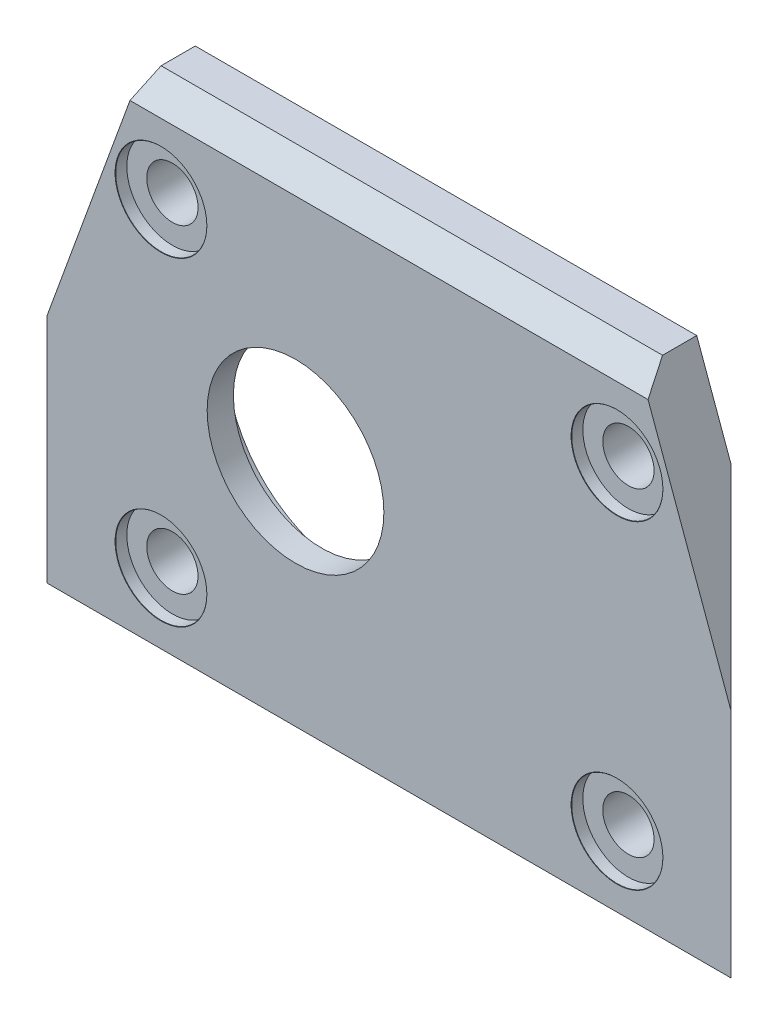
ISO-10303-21;
HEADER;
FILE_DESCRIPTION(('STEP AP214'),'2;1');
FILE_NAME('part.step','',(''),(''),'','','');
FILE_SCHEMA(('AUTOMOTIVE_DESIGN { 1 0 10303 214 1 1 1 1 }'));
ENDSEC;
DATA;
#1=APPLICATION_CONTEXT('core data for automotive mechanical design processes');
#2=APPLICATION_PROTOCOL_DEFINITION('international standard','automotive_design',2000,#1);
#3=PRODUCT_CONTEXT('',#1,'mechanical');
#4=PRODUCT('Part','Part','',(#3));
#5=PRODUCT_RELATED_PRODUCT_CATEGORY('part','',(#4));
#6=PRODUCT_DEFINITION_FORMATION('','',#4);
#7=PRODUCT_DEFINITION_CONTEXT('part definition',#1,'design');
#8=PRODUCT_DEFINITION('design','',#6,#7);
#9=PRODUCT_DEFINITION_SHAPE('','',#8);
#10=(LENGTH_UNIT() NAMED_UNIT(*) SI_UNIT(.MILLI.,.METRE.));
#11=(NAMED_UNIT(*) PLANE_ANGLE_UNIT() SI_UNIT($,.RADIAN.));
#12=(NAMED_UNIT(*) SI_UNIT($,.STERADIAN.) SOLID_ANGLE_UNIT());
#13=UNCERTAINTY_MEASURE_WITH_UNIT(LENGTH_MEASURE(1.E-05),#10,'distance_accuracy_value','');
#14=(GEOMETRIC_REPRESENTATION_CONTEXT(3) GLOBAL_UNCERTAINTY_ASSIGNED_CONTEXT((#13)) GLOBAL_UNIT_ASSIGNED_CONTEXT((#10,
#11,#12)) REPRESENTATION_CONTEXT('',''));
#15=CARTESIAN_POINT('',(0.,0.,0.));
#16=DIRECTION('',(0.,0.,1.));
#17=DIRECTION('',(1.,0.,0.));
#18=AXIS2_PLACEMENT_3D('',#15,#16,#17);
#19=CARTESIAN_POINT('',(-8.2,0.,5.));
#20=DIRECTION('',(0.,0.,-1.));
#21=DIRECTION('',(-1.,0.,0.));
#22=AXIS2_PLACEMENT_3D('',#19,#20,#21);
#23=CYLINDRICAL_SURFACE('',#22,7.75);
#24=CARTESIAN_POINT('',(-8.2,0.,5.));
#25=DIRECTION('',(0.,0.,1.));
#26=DIRECTION('',(1.,0.,0.));
#27=AXIS2_PLACEMENT_3D('',#24,#25,#26);
#28=CIRCLE('',#27,7.75);
#29=CARTESIAN_POINT('',(-0.450000000000001,0.,5.));
#30=VERTEX_POINT('',#29);
#31=EDGE_CURVE('E195',#30,#30,#28,.T.);
#32=ORIENTED_EDGE('',*,*,#31,.T.);
#33=EDGE_LOOP('',(#32));
#34=FACE_BOUND('',#33,.T.);
#35=CARTESIAN_POINT('',(-8.2,0.,2.7));
#36=DIRECTION('',(0.,0.,-1.));
#37=DIRECTION('',(-1.,0.,0.));
#38=AXIS2_PLACEMENT_3D('',#35,#36,#37);
#39=CIRCLE('',#38,7.75);
#40=CARTESIAN_POINT('',(-15.95,0.,2.7));
#41=VERTEX_POINT('',#40);
#42=EDGE_CURVE('E135',#41,#41,#39,.T.);
#43=ORIENTED_EDGE('',*,*,#42,.T.);
#44=EDGE_LOOP('',(#43));
#45=FACE_BOUND('',#44,.T.);
#46=ADVANCED_FACE('F35',(#34,#45),#23,.F.);
#47=CARTESIAN_POINT('',(-20.,14.,5.));
#48=DIRECTION('',(0.,0.,-1.));
#49=DIRECTION('',(-1.,0.,0.));
#50=AXIS2_PLACEMENT_3D('',#47,#48,#49);
#51=CYLINDRICAL_SURFACE('',#50,2.25);
#52=CARTESIAN_POINT('',(-20.,14.,0.));
#53=DIRECTION('',(0.,0.,1.));
#54=DIRECTION('',(1.,0.,0.));
#55=AXIS2_PLACEMENT_3D('',#52,#53,#54);
#56=CIRCLE('',#55,2.25);
#57=CARTESIAN_POINT('',(-17.75,14.,0.));
#58=VERTEX_POINT('',#57);
#59=EDGE_CURVE('E123',#58,#58,#56,.T.);
#60=ORIENTED_EDGE('',*,*,#59,.F.);
#61=EDGE_LOOP('',(#60));
#62=FACE_BOUND('',#61,.T.);
#63=CARTESIAN_POINT('',(-20.,14.,4.));
#64=DIRECTION('',(0.,0.,1.));
#65=DIRECTION('',(1.,0.,0.));
#66=AXIS2_PLACEMENT_3D('',#63,#64,#65);
#67=CIRCLE('',#66,2.25);
#68=CARTESIAN_POINT('',(-17.75,14.,4.));
#69=VERTEX_POINT('',#68);
#70=EDGE_CURVE('E234',#69,#69,#67,.T.);
#71=ORIENTED_EDGE('',*,*,#70,.T.);
#72=EDGE_LOOP('',(#71));
#73=FACE_BOUND('',#72,.T.);
#74=ADVANCED_FACE('F285',(#62,#73),#51,.F.);
#75=CARTESIAN_POINT('',(20.,14.,5.));
#76=DIRECTION('',(0.,0.,-1.));
#77=DIRECTION('',(-1.,0.,0.));
#78=AXIS2_PLACEMENT_3D('',#75,#76,#77);
#79=CYLINDRICAL_SURFACE('',#78,2.25);
#80=CARTESIAN_POINT('',(20.,14.,0.));
#81=DIRECTION('',(0.,0.,1.));
#82=DIRECTION('',(1.,0.,0.));
#83=AXIS2_PLACEMENT_3D('',#80,#81,#82);
#84=CIRCLE('',#83,2.25);
#85=CARTESIAN_POINT('',(22.25,14.,0.));
#86=VERTEX_POINT('',#85);
#87=EDGE_CURVE('E189',#86,#86,#84,.T.);
#88=ORIENTED_EDGE('',*,*,#87,.F.);
#89=EDGE_LOOP('',(#88));
#90=FACE_BOUND('',#89,.T.);
#91=CARTESIAN_POINT('',(20.,14.,4.));
#92=DIRECTION('',(0.,0.,1.));
#93=DIRECTION('',(1.,0.,0.));
#94=AXIS2_PLACEMENT_3D('',#91,#92,#93);
#95=CIRCLE('',#94,2.25);
#96=CARTESIAN_POINT('',(22.25,14.,4.));
#97=VERTEX_POINT('',#96);
#98=EDGE_CURVE('E222',#97,#97,#95,.T.);
#99=ORIENTED_EDGE('',*,*,#98,.T.);
#100=EDGE_LOOP('',(#99));
#101=FACE_BOUND('',#100,.T.);
#102=ADVANCED_FACE('F291',(#90,#101),#79,.F.);
#103=CARTESIAN_POINT('',(20.,-14.,5.));
#104=DIRECTION('',(0.,0.,-1.));
#105=DIRECTION('',(-1.,0.,0.));
#106=AXIS2_PLACEMENT_3D('',#103,#104,#105);
#107=CYLINDRICAL_SURFACE('',#106,2.25);
#108=CARTESIAN_POINT('',(20.,-14.,0.));
#109=DIRECTION('',(0.,0.,1.));
#110=DIRECTION('',(1.,0.,0.));
#111=AXIS2_PLACEMENT_3D('',#108,#109,#110);
#112=CIRCLE('',#111,2.25);
#113=CARTESIAN_POINT('',(22.25,-14.,0.));
#114=VERTEX_POINT('',#113);
#115=EDGE_CURVE('E192',#114,#114,#112,.T.);
#116=ORIENTED_EDGE('',*,*,#115,.F.);
#117=EDGE_LOOP('',(#116));
#118=FACE_BOUND('',#117,.T.);
#119=CARTESIAN_POINT('',(20.,-14.,4.));
#120=DIRECTION('',(0.,0.,1.));
#121=DIRECTION('',(1.,0.,0.));
#122=AXIS2_PLACEMENT_3D('',#119,#120,#121);
#123=CIRCLE('',#122,2.25);
#124=CARTESIAN_POINT('',(22.25,-14.,4.));
#125=VERTEX_POINT('',#124);
#126=EDGE_CURVE('E210',#125,#125,#123,.T.);
#127=ORIENTED_EDGE('',*,*,#126,.T.);
#128=EDGE_LOOP('',(#127));
#129=FACE_BOUND('',#128,.T.);
#130=ADVANCED_FACE('F296',(#118,#129),#107,.F.);
#131=CARTESIAN_POINT('',(0.,0.,5.));
#132=DIRECTION('',(0.,0.,-1.));
#133=DIRECTION('',(-1.,0.,0.));
#134=AXIS2_PLACEMENT_3D('',#131,#132,#133);
#135=PLANE('',#134);
#136=CARTESIAN_POINT('',(-20.,14.,5.));
#137=DIRECTION('',(0.,0.,1.));
#138=DIRECTION('',(1.,0.,0.));
#139=AXIS2_PLACEMENT_3D('',#136,#137,#138);
#140=CIRCLE('',#139,4.025);
#141=CARTESIAN_POINT('',(-15.975,14.,5.));
#142=VERTEX_POINT('',#141);
#143=EDGE_CURVE('E138',#142,#142,#140,.T.);
#144=ORIENTED_EDGE('',*,*,#143,.F.);
#145=EDGE_LOOP('',(#144));
#146=FACE_BOUND('',#145,.T.);
#147=CARTESIAN_POINT('',(20.,14.,5.));
#148=DIRECTION('',(0.,0.,1.));
#149=DIRECTION('',(1.,0.,0.));
#150=AXIS2_PLACEMENT_3D('',#147,#148,#149);
#151=CIRCLE('',#150,4.025);
#152=CARTESIAN_POINT('',(24.025,14.,5.));
#153=VERTEX_POINT('',#152);
#154=EDGE_CURVE('E231',#153,#153,#151,.T.);
#155=ORIENTED_EDGE('',*,*,#154,.F.);
#156=EDGE_LOOP('',(#155));
#157=FACE_BOUND('',#156,.T.);
#158=ORIENTED_EDGE('',*,*,#31,.F.);
#159=EDGE_LOOP('',(#158));
#160=FACE_BOUND('',#159,.T.);
#161=DIRECTION('',(0.,-1.,0.));
#162=VECTOR('',#161,1.);
#163=CARTESIAN_POINT('',(-30.,-22.15,5.));
#164=LINE('',#163,#162);
#165=CARTESIAN_POINT('',(-30.,0.149999999999786,5.));
#166=VERTEX_POINT('',#165);
#167=CARTESIAN_POINT('',(-30.,-20.15,5.));
#168=VERTEX_POINT('',#167);
#169=EDGE_CURVE('E132',#166,#168,#164,.T.);
#170=ORIENTED_EDGE('',*,*,#169,.T.);
#171=DIRECTION('',(1.,0.,0.));
#172=VECTOR('',#171,1.);
#173=CARTESIAN_POINT('',(0.,-20.15,5.));
#174=LINE('',#173,#172);
#175=CARTESIAN_POINT('',(30.,-20.15,5.));
#176=VERTEX_POINT('',#175);
#177=EDGE_CURVE('E150',#168,#176,#174,.T.);
#178=ORIENTED_EDGE('',*,*,#177,.T.);
#179=DIRECTION('',(0.,1.,0.));
#180=VECTOR('',#179,1.);
#181=CARTESIAN_POINT('',(30.,-22.15,5.));
#182=LINE('',#181,#180);
#183=CARTESIAN_POINT('',(30.,0.149999999999786,5.));
#184=VERTEX_POINT('',#183);
#185=EDGE_CURVE('E126',#176,#184,#182,.T.);
#186=ORIENTED_EDGE('',*,*,#185,.T.);
#187=DIRECTION('',(0.342020143325666,-0.939692620785909,0.));
#188=VECTOR('',#187,1.);
#189=CARTESIAN_POINT('',(21.9926548461435,22.15,5.));
#190=LINE('',#189,#188);
#191=CARTESIAN_POINT('',(22.7205953146759,20.15,5.));
#192=VERTEX_POINT('',#191);
#193=EDGE_CURVE('E144',#184,#192,#190,.F.);
#194=ORIENTED_EDGE('',*,*,#193,.T.);
#195=DIRECTION('',(-1.,0.,0.));
#196=VECTOR('',#195,1.);
#197=CARTESIAN_POINT('',(0.,20.15,5.));
#198=LINE('',#197,#196);
#199=CARTESIAN_POINT('',(-22.7205953146759,20.15,5.));
#200=VERTEX_POINT('',#199);
#201=EDGE_CURVE('E147',#192,#200,#198,.T.);
#202=ORIENTED_EDGE('',*,*,#201,.T.);
#203=DIRECTION('',(0.342020143325667,0.939692620785909,0.));
#204=VECTOR('',#203,1.);
#205=CARTESIAN_POINT('',(-30.,0.149999999999786,5.));
#206=LINE('',#205,#204);
#207=EDGE_CURVE('E116',#200,#166,#206,.F.);
#208=ORIENTED_EDGE('',*,*,#207,.T.);
#209=EDGE_LOOP('',(#170,#178,#186,#194,#202,#208));
#210=FACE_BOUND('',#209,.T.);
#211=CARTESIAN_POINT('',(-20.,-14.,5.));
#212=DIRECTION('',(0.,0.,1.));
#213=DIRECTION('',(1.,0.,0.));
#214=AXIS2_PLACEMENT_3D('',#211,#212,#213);
#215=CIRCLE('',#214,4.025);
#216=CARTESIAN_POINT('',(-15.975,-14.,5.));
#217=VERTEX_POINT('',#216);
#218=EDGE_CURVE('E207',#217,#217,#215,.T.);
#219=ORIENTED_EDGE('',*,*,#218,.F.);
#220=EDGE_LOOP('',(#219));
#221=FACE_BOUND('',#220,.T.);
#222=CARTESIAN_POINT('',(20.,-14.,5.));
#223=DIRECTION('',(0.,0.,1.));
#224=DIRECTION('',(1.,0.,0.));
#225=AXIS2_PLACEMENT_3D('',#222,#223,#224);
#226=CIRCLE('',#225,4.025);
#227=CARTESIAN_POINT('',(24.025,-14.,5.));
#228=VERTEX_POINT('',#227);
#229=EDGE_CURVE('E219',#228,#228,#226,.T.);
#230=ORIENTED_EDGE('',*,*,#229,.F.);
#231=EDGE_LOOP('',(#230));
#232=FACE_BOUND('',#231,.T.);
#233=ADVANCED_FACE('F178',(#146,#157,#160,#210,#221,#232),#135,.F.);
#234=CARTESIAN_POINT('',(0.,0.,0.));
#235=DIRECTION('',(0.,0.,-1.));
#236=DIRECTION('',(-1.,0.,0.));
#237=AXIS2_PLACEMENT_3D('',#234,#235,#236);
#238=PLANE('',#237);
#239=CARTESIAN_POINT('',(-8.2,0.,0.));
#240=DIRECTION('',(0.,0.,-1.));
#241=DIRECTION('',(-1.,0.,0.));
#242=AXIS2_PLACEMENT_3D('',#239,#240,#241);
#243=CIRCLE('',#242,11.1);
#244=CARTESIAN_POINT('',(-19.3,0.,0.));
#245=VERTEX_POINT('',#244);
#246=EDGE_CURVE('E245',#245,#245,#243,.T.);
#247=ORIENTED_EDGE('',*,*,#246,.F.);
#248=EDGE_LOOP('',(#247));
#249=FACE_BOUND('',#248,.T.);
#250=ORIENTED_EDGE('',*,*,#115,.T.);
#251=EDGE_LOOP('',(#250));
#252=FACE_BOUND('',#251,.T.);
#253=CARTESIAN_POINT('',(-20.,-14.,0.));
#254=DIRECTION('',(0.,0.,1.));
#255=DIRECTION('',(1.,0.,0.));
#256=AXIS2_PLACEMENT_3D('',#253,#254,#255);
#257=CIRCLE('',#256,2.25);
#258=CARTESIAN_POINT('',(-17.75,-14.,0.));
#259=VERTEX_POINT('',#258);
#260=EDGE_CURVE('E129',#259,#259,#257,.T.);
#261=ORIENTED_EDGE('',*,*,#260,.T.);
#262=EDGE_LOOP('',(#261));
#263=FACE_BOUND('',#262,.T.);
#264=DIRECTION('',(1.,0.,0.));
#265=VECTOR('',#264,1.);
#266=CARTESIAN_POINT('',(-30.,-22.15,0.));
#267=LINE('',#266,#265);
#268=CARTESIAN_POINT('',(-25.,-22.15,0.));
#269=VERTEX_POINT('',#268);
#270=CARTESIAN_POINT('',(25.,-22.15,0.));
#271=VERTEX_POINT('',#270);
#272=EDGE_CURVE('E122',#269,#271,#267,.T.);
#273=ORIENTED_EDGE('',*,*,#272,.F.);
#274=DIRECTION('',(0.,1.,0.));
#275=VECTOR('',#274,1.);
#276=CARTESIAN_POINT('',(-25.,0.149999999999786,0.));
#277=LINE('',#276,#275);
#278=CARTESIAN_POINT('',(-25.,13.887387097273,0.));
#279=VERTEX_POINT('',#278);
#280=EDGE_CURVE('E172',#269,#279,#277,.T.);
#281=ORIENTED_EDGE('',*,*,#280,.T.);
#282=DIRECTION('',(-0.342020143325667,-0.939692620785909,0.));
#283=VECTOR('',#282,1.);
#284=CARTESIAN_POINT('',(-26.5388757175111,9.65936081206409,0.));
#285=LINE('',#284,#283);
#286=CARTESIAN_POINT('',(-21.9926548461435,22.15,0.));
#287=VERTEX_POINT('',#286);
#288=EDGE_CURVE('E108',#279,#287,#285,.F.);
#289=ORIENTED_EDGE('',*,*,#288,.T.);
#290=DIRECTION('',(-1.,0.,0.));
#291=VECTOR('',#290,1.);
#292=CARTESIAN_POINT('',(-30.,22.15,0.));
#293=LINE('',#292,#291);
#294=CARTESIAN_POINT('',(21.9926548461435,22.15,0.));
#295=VERTEX_POINT('',#294);
#296=EDGE_CURVE('E104',#295,#287,#293,.T.);
#297=ORIENTED_EDGE('',*,*,#296,.F.);
#298=DIRECTION('',(-0.342020143325666,0.939692620785909,0.));
#299=VECTOR('',#298,1.);
#300=CARTESIAN_POINT('',(26.5388757175111,9.65936081206408,0.));
#301=LINE('',#300,#299);
#302=CARTESIAN_POINT('',(25.,13.887387097273,0.));
#303=VERTEX_POINT('',#302);
#304=EDGE_CURVE('E112',#295,#303,#301,.F.);
#305=ORIENTED_EDGE('',*,*,#304,.T.);
#306=DIRECTION('',(0.,-1.,0.));
#307=VECTOR('',#306,1.);
#308=CARTESIAN_POINT('',(25.,-22.15,0.));
#309=LINE('',#308,#307);
#310=EDGE_CURVE('E170',#303,#271,#309,.T.);
#311=ORIENTED_EDGE('',*,*,#310,.T.);
#312=EDGE_LOOP('',(#273,#281,#289,#297,#305,#311));
#313=FACE_BOUND('',#312,.T.);
#314=ORIENTED_EDGE('',*,*,#59,.T.);
#315=EDGE_LOOP('',(#314));
#316=FACE_BOUND('',#315,.T.);
#317=ORIENTED_EDGE('',*,*,#87,.T.);
#318=EDGE_LOOP('',(#317));
#319=FACE_BOUND('',#318,.T.);
#320=ADVANCED_FACE('F119',(#249,#252,#263,#313,#316,#319),#238,.T.);
#321=CARTESIAN_POINT('',(-30.,22.15,5.));
#322=DIRECTION('',(0.,-1.,0.));
#323=DIRECTION('',(0.,0.,-1.));
#324=AXIS2_PLACEMENT_3D('',#321,#322,#323);
#325=PLANE('',#324);
#326=DIRECTION('',(0.,0.,1.));
#327=VECTOR('',#326,1.);
#328=CARTESIAN_POINT('',(-21.9926548461435,22.15,5.));
#329=LINE('',#328,#327);
#330=CARTESIAN_POINT('',(-21.9926548461435,22.15,2.99999999999999));
#331=VERTEX_POINT('',#330);
#332=EDGE_CURVE('E109',#287,#331,#329,.T.);
#333=ORIENTED_EDGE('',*,*,#332,.T.);
#334=DIRECTION('',(1.,0.,0.));
#335=VECTOR('',#334,1.);
#336=CARTESIAN_POINT('',(-30.,22.15,2.99999999999999));
#337=LINE('',#336,#335);
#338=CARTESIAN_POINT('',(21.9926548461435,22.15,2.99999999999999));
#339=VERTEX_POINT('',#338);
#340=EDGE_CURVE('E107',#331,#339,#337,.T.);
#341=ORIENTED_EDGE('',*,*,#340,.T.);
#342=DIRECTION('',(0.,0.,-1.));
#343=VECTOR('',#342,1.);
#344=CARTESIAN_POINT('',(21.9926548461435,22.15,5.));
#345=LINE('',#344,#343);
#346=EDGE_CURVE('E100',#339,#295,#345,.T.);
#347=ORIENTED_EDGE('',*,*,#346,.T.);
#348=ORIENTED_EDGE('',*,*,#296,.T.);
#349=EDGE_LOOP('',(#333,#341,#347,#348));
#350=FACE_BOUND('',#349,.T.);
#351=ADVANCED_FACE('F102',(#350),#325,.F.);
#352=CARTESIAN_POINT('',(-30.,-22.15,5.));
#353=DIRECTION('',(0.,1.,0.));
#354=DIRECTION('',(0.,0.,1.));
#355=AXIS2_PLACEMENT_3D('',#352,#353,#354);
#356=PLANE('',#355);
#357=DIRECTION('',(-1.,0.,0.));
#358=VECTOR('',#357,1.);
#359=CARTESIAN_POINT('',(-30.,-22.15,2.99999999999999));
#360=LINE('',#359,#358);
#361=CARTESIAN_POINT('',(28.,-22.15,2.99999999999999));
#362=VERTEX_POINT('',#361);
#363=CARTESIAN_POINT('',(-28.,-22.15,2.99999999999999));
#364=VERTEX_POINT('',#363);
#365=EDGE_CURVE('E153',#362,#364,#360,.T.);
#366=ORIENTED_EDGE('',*,*,#365,.T.);
#367=DIRECTION('',(0.707106781186548,0.,-0.707106781186547));
#368=VECTOR('',#367,1.);
#369=CARTESIAN_POINT('',(-30.,-22.15,5.));
#370=LINE('',#369,#368);
#371=EDGE_CURVE('E168',#364,#269,#370,.T.);
#372=ORIENTED_EDGE('',*,*,#371,.T.);
#373=ORIENTED_EDGE('',*,*,#272,.T.);
#374=DIRECTION('',(0.707106781186548,0.,0.707106781186547));
#375=VECTOR('',#374,1.);
#376=CARTESIAN_POINT('',(30.,-22.15,5.));
#377=LINE('',#376,#375);
#378=EDGE_CURVE('E165',#271,#362,#377,.T.);
#379=ORIENTED_EDGE('',*,*,#378,.T.);
#380=EDGE_LOOP('',(#366,#372,#373,#379));
#381=FACE_BOUND('',#380,.T.);
#382=ADVANCED_FACE('F270',(#381),#356,.F.);
#383=CARTESIAN_POINT('',(-20.,-14.,5.));
#384=DIRECTION('',(0.,0.,-1.));
#385=DIRECTION('',(-1.,0.,0.));
#386=AXIS2_PLACEMENT_3D('',#383,#384,#385);
#387=CYLINDRICAL_SURFACE('',#386,2.25);
#388=CARTESIAN_POINT('',(-20.,-14.,4.));
#389=DIRECTION('',(0.,0.,1.));
#390=DIRECTION('',(1.,0.,0.));
#391=AXIS2_PLACEMENT_3D('',#388,#389,#390);
#392=CIRCLE('',#391,2.25);
#393=CARTESIAN_POINT('',(-17.75,-14.,4.));
#394=VERTEX_POINT('',#393);
#395=EDGE_CURVE('E198',#394,#394,#392,.T.);
#396=ORIENTED_EDGE('',*,*,#395,.T.);
#397=EDGE_LOOP('',(#396));
#398=FACE_BOUND('',#397,.T.);
#399=ORIENTED_EDGE('',*,*,#260,.F.);
#400=EDGE_LOOP('',(#399));
#401=FACE_BOUND('',#400,.T.);
#402=ADVANCED_FACE('F267',(#398,#401),#387,.F.);
#403=CARTESIAN_POINT('',(-16.,-14.,4.));
#404=DIRECTION('',(0.,0.,-1.));
#405=DIRECTION('',(-1.,0.,0.));
#406=AXIS2_PLACEMENT_3D('',#403,#404,#405);
#407=PLANE('',#406);
#408=ORIENTED_EDGE('',*,*,#395,.F.);
#409=EDGE_LOOP('',(#408));
#410=FACE_BOUND('',#409,.T.);
#411=CARTESIAN_POINT('',(-20.,-14.,4.));
#412=DIRECTION('',(0.,0.,1.));
#413=DIRECTION('',(1.,0.,0.));
#414=AXIS2_PLACEMENT_3D('',#411,#412,#413);
#415=CIRCLE('',#414,4.);
#416=CARTESIAN_POINT('',(-16.,-14.,4.));
#417=VERTEX_POINT('',#416);
#418=EDGE_CURVE('E201',#417,#417,#415,.T.);
#419=ORIENTED_EDGE('',*,*,#418,.T.);
#420=EDGE_LOOP('',(#419));
#421=FACE_BOUND('',#420,.T.);
#422=ADVANCED_FACE('F269',(#410,#421),#407,.F.);
#423=CARTESIAN_POINT('',(-20.,-14.,5.));
#424=DIRECTION('',(0.,0.,1.));
#425=DIRECTION('',(1.,0.,0.));
#426=AXIS2_PLACEMENT_3D('',#423,#424,#425);
#427=CYLINDRICAL_SURFACE('',#426,4.);
#428=ORIENTED_EDGE('',*,*,#418,.F.);
#429=EDGE_LOOP('',(#428));
#430=FACE_BOUND('',#429,.T.);
#431=CARTESIAN_POINT('',(-20.,-14.,4.975));
#432=DIRECTION('',(0.,0.,1.));
#433=DIRECTION('',(1.,0.,0.));
#434=AXIS2_PLACEMENT_3D('',#431,#432,#433);
#435=CIRCLE('',#434,4.);
#436=CARTESIAN_POINT('',(-16.,-14.,4.975));
#437=VERTEX_POINT('',#436);
#438=EDGE_CURVE('E204',#437,#437,#435,.T.);
#439=ORIENTED_EDGE('',*,*,#438,.T.);
#440=EDGE_LOOP('',(#439));
#441=FACE_BOUND('',#440,.T.);
#442=ADVANCED_FACE('F277',(#430,#441),#427,.F.);
#443=CARTESIAN_POINT('',(-20.,-14.,5.));
#444=DIRECTION('',(0.,0.,1.));
#445=DIRECTION('',(1.,0.,0.));
#446=AXIS2_PLACEMENT_3D('',#443,#444,#445);
#447=CONICAL_SURFACE('',#446,4.025,0.785398163397431);
#448=ORIENTED_EDGE('',*,*,#438,.F.);
#449=EDGE_LOOP('',(#448));
#450=FACE_BOUND('',#449,.T.);
#451=ORIENTED_EDGE('',*,*,#218,.T.);
#452=EDGE_LOOP('',(#451));
#453=FACE_BOUND('',#452,.T.);
#454=ADVANCED_FACE('F475',(#450,#453),#447,.F.);
#455=CARTESIAN_POINT('',(24.,-14.,4.));
#456=DIRECTION('',(0.,0.,-1.));
#457=DIRECTION('',(-1.,0.,0.));
#458=AXIS2_PLACEMENT_3D('',#455,#456,#457);
#459=PLANE('',#458);
#460=ORIENTED_EDGE('',*,*,#126,.F.);
#461=EDGE_LOOP('',(#460));
#462=FACE_BOUND('',#461,.T.);
#463=CARTESIAN_POINT('',(20.,-14.,4.));
#464=DIRECTION('',(0.,0.,1.));
#465=DIRECTION('',(1.,0.,0.));
#466=AXIS2_PLACEMENT_3D('',#463,#464,#465);
#467=CIRCLE('',#466,4.);
#468=CARTESIAN_POINT('',(24.,-14.,4.));
#469=VERTEX_POINT('',#468);
#470=EDGE_CURVE('E213',#469,#469,#467,.T.);
#471=ORIENTED_EDGE('',*,*,#470,.T.);
#472=EDGE_LOOP('',(#471));
#473=FACE_BOUND('',#472,.T.);
#474=ADVANCED_FACE('F465',(#462,#473),#459,.F.);
#475=CARTESIAN_POINT('',(20.,-14.,5.));
#476=DIRECTION('',(0.,0.,1.));
#477=DIRECTION('',(1.,0.,0.));
#478=AXIS2_PLACEMENT_3D('',#475,#476,#477);
#479=CYLINDRICAL_SURFACE('',#478,4.);
#480=ORIENTED_EDGE('',*,*,#470,.F.);
#481=EDGE_LOOP('',(#480));
#482=FACE_BOUND('',#481,.T.);
#483=CARTESIAN_POINT('',(20.,-14.,4.975));
#484=DIRECTION('',(0.,0.,1.));
#485=DIRECTION('',(1.,0.,0.));
#486=AXIS2_PLACEMENT_3D('',#483,#484,#485);
#487=CIRCLE('',#486,4.);
#488=CARTESIAN_POINT('',(24.,-14.,4.975));
#489=VERTEX_POINT('',#488);
#490=EDGE_CURVE('E216',#489,#489,#487,.T.);
#491=ORIENTED_EDGE('',*,*,#490,.T.);
#492=EDGE_LOOP('',(#491));
#493=FACE_BOUND('',#492,.T.);
#494=ADVANCED_FACE('F455',(#482,#493),#479,.F.);
#495=CARTESIAN_POINT('',(20.,-14.,5.));
#496=DIRECTION('',(0.,0.,1.));
#497=DIRECTION('',(1.,0.,0.));
#498=AXIS2_PLACEMENT_3D('',#495,#496,#497);
#499=CONICAL_SURFACE('',#498,4.025,0.785398163397431);
#500=ORIENTED_EDGE('',*,*,#490,.F.);
#501=EDGE_LOOP('',(#500));
#502=FACE_BOUND('',#501,.T.);
#503=ORIENTED_EDGE('',*,*,#229,.T.);
#504=EDGE_LOOP('',(#503));
#505=FACE_BOUND('',#504,.T.);
#506=ADVANCED_FACE('F311',(#502,#505),#499,.F.);
#507=CARTESIAN_POINT('',(24.,14.,4.));
#508=DIRECTION('',(0.,0.,-1.));
#509=DIRECTION('',(-1.,0.,0.));
#510=AXIS2_PLACEMENT_3D('',#507,#508,#509);
#511=PLANE('',#510);
#512=ORIENTED_EDGE('',*,*,#98,.F.);
#513=EDGE_LOOP('',(#512));
#514=FACE_BOUND('',#513,.T.);
#515=CARTESIAN_POINT('',(20.,14.,4.));
#516=DIRECTION('',(0.,0.,1.));
#517=DIRECTION('',(1.,0.,0.));
#518=AXIS2_PLACEMENT_3D('',#515,#516,#517);
#519=CIRCLE('',#518,4.);
#520=CARTESIAN_POINT('',(24.,14.,4.));
#521=VERTEX_POINT('',#520);
#522=EDGE_CURVE('E225',#521,#521,#519,.T.);
#523=ORIENTED_EDGE('',*,*,#522,.T.);
#524=EDGE_LOOP('',(#523));
#525=FACE_BOUND('',#524,.T.);
#526=ADVANCED_FACE('F307',(#514,#525),#511,.F.);
#527=CARTESIAN_POINT('',(20.,14.,5.));
#528=DIRECTION('',(0.,0.,1.));
#529=DIRECTION('',(1.,0.,0.));
#530=AXIS2_PLACEMENT_3D('',#527,#528,#529);
#531=CYLINDRICAL_SURFACE('',#530,4.);
#532=ORIENTED_EDGE('',*,*,#522,.F.);
#533=EDGE_LOOP('',(#532));
#534=FACE_BOUND('',#533,.T.);
#535=CARTESIAN_POINT('',(20.,14.,4.975));
#536=DIRECTION('',(0.,0.,1.));
#537=DIRECTION('',(1.,0.,0.));
#538=AXIS2_PLACEMENT_3D('',#535,#536,#537);
#539=CIRCLE('',#538,4.);
#540=CARTESIAN_POINT('',(24.,14.,4.975));
#541=VERTEX_POINT('',#540);
#542=EDGE_CURVE('E228',#541,#541,#539,.T.);
#543=ORIENTED_EDGE('',*,*,#542,.T.);
#544=EDGE_LOOP('',(#543));
#545=FACE_BOUND('',#544,.T.);
#546=ADVANCED_FACE('F310',(#534,#545),#531,.F.);
#547=CARTESIAN_POINT('',(20.,14.,5.));
#548=DIRECTION('',(0.,0.,1.));
#549=DIRECTION('',(1.,0.,0.));
#550=AXIS2_PLACEMENT_3D('',#547,#548,#549);
#551=CONICAL_SURFACE('',#550,4.025,0.785398163397431);
#552=ORIENTED_EDGE('',*,*,#542,.F.);
#553=EDGE_LOOP('',(#552));
#554=FACE_BOUND('',#553,.T.);
#555=ORIENTED_EDGE('',*,*,#154,.T.);
#556=EDGE_LOOP('',(#555));
#557=FACE_BOUND('',#556,.T.);
#558=ADVANCED_FACE('F317',(#554,#557),#551,.F.);
#559=CARTESIAN_POINT('',(-16.,14.,4.));
#560=DIRECTION('',(0.,0.,-1.));
#561=DIRECTION('',(-1.,0.,0.));
#562=AXIS2_PLACEMENT_3D('',#559,#560,#561);
#563=PLANE('',#562);
#564=ORIENTED_EDGE('',*,*,#70,.F.);
#565=EDGE_LOOP('',(#564));
#566=FACE_BOUND('',#565,.T.);
#567=CARTESIAN_POINT('',(-20.,14.,4.));
#568=DIRECTION('',(0.,0.,1.));
#569=DIRECTION('',(1.,0.,0.));
#570=AXIS2_PLACEMENT_3D('',#567,#568,#569);
#571=CIRCLE('',#570,4.);
#572=CARTESIAN_POINT('',(-16.,14.,4.));
#573=VERTEX_POINT('',#572);
#574=EDGE_CURVE('E237',#573,#573,#571,.T.);
#575=ORIENTED_EDGE('',*,*,#574,.T.);
#576=EDGE_LOOP('',(#575));
#577=FACE_BOUND('',#576,.T.);
#578=ADVANCED_FACE('F323',(#566,#577),#563,.F.);
#579=CARTESIAN_POINT('',(-20.,14.,5.));
#580=DIRECTION('',(0.,0.,1.));
#581=DIRECTION('',(1.,0.,0.));
#582=AXIS2_PLACEMENT_3D('',#579,#580,#581);
#583=CYLINDRICAL_SURFACE('',#582,4.);
#584=ORIENTED_EDGE('',*,*,#574,.F.);
#585=EDGE_LOOP('',(#584));
#586=FACE_BOUND('',#585,.T.);
#587=CARTESIAN_POINT('',(-20.,14.,4.975));
#588=DIRECTION('',(0.,0.,1.));
#589=DIRECTION('',(1.,0.,0.));
#590=AXIS2_PLACEMENT_3D('',#587,#588,#589);
#591=CIRCLE('',#590,4.);
#592=CARTESIAN_POINT('',(-16.,14.,4.975));
#593=VERTEX_POINT('',#592);
#594=EDGE_CURVE('E240',#593,#593,#591,.T.);
#595=ORIENTED_EDGE('',*,*,#594,.T.);
#596=EDGE_LOOP('',(#595));
#597=FACE_BOUND('',#596,.T.);
#598=ADVANCED_FACE('F409',(#586,#597),#583,.F.);
#599=CARTESIAN_POINT('',(-20.,14.,5.));
#600=DIRECTION('',(0.,0.,1.));
#601=DIRECTION('',(1.,0.,0.));
#602=AXIS2_PLACEMENT_3D('',#599,#600,#601);
#603=CONICAL_SURFACE('',#602,4.025,0.785398163397431);
#604=ORIENTED_EDGE('',*,*,#594,.F.);
#605=EDGE_LOOP('',(#604));
#606=FACE_BOUND('',#605,.T.);
#607=ORIENTED_EDGE('',*,*,#143,.T.);
#608=EDGE_LOOP('',(#607));
#609=FACE_BOUND('',#608,.T.);
#610=ADVANCED_FACE('F256',(#606,#609),#603,.F.);
#611=CARTESIAN_POINT('',(-8.2,0.,2.7));
#612=DIRECTION('',(0.,0.,-1.));
#613=DIRECTION('',(-1.,0.,0.));
#614=AXIS2_PLACEMENT_3D('',#611,#612,#613);
#615=CYLINDRICAL_SURFACE('',#614,11.1);
#616=CARTESIAN_POINT('',(-8.2,0.,2.7));
#617=DIRECTION('',(0.,0.,-1.));
#618=DIRECTION('',(-1.,0.,0.));
#619=AXIS2_PLACEMENT_3D('',#616,#617,#618);
#620=CIRCLE('',#619,11.1);
#621=CARTESIAN_POINT('',(-19.3,0.,2.7));
#622=VERTEX_POINT('',#621);
#623=EDGE_CURVE('E139',#622,#622,#620,.T.);
#624=CARTESIAN_POINT('',(-19.3,0.,2.7));
#625=CARTESIAN_POINT('',(-19.3,0.,2.671875));
#626=CARTESIAN_POINT('',(-19.3,0.,2.64375));
#627=CARTESIAN_POINT('',(-19.3,0.,2.5875));
#628=CARTESIAN_POINT('',(-19.3,0.,2.559375));
#629=CARTESIAN_POINT('',(-19.3,0.,2.503125));
#630=CARTESIAN_POINT('',(-19.3,0.,2.475));
#631=CARTESIAN_POINT('',(-19.3,0.,2.41875));
#632=CARTESIAN_POINT('',(-19.3,0.,2.390625));
#633=CARTESIAN_POINT('',(-19.3,0.,2.334375));
#634=CARTESIAN_POINT('',(-19.3,0.,2.30625));
#635=CARTESIAN_POINT('',(-19.3,0.,2.25));
#636=CARTESIAN_POINT('',(-19.3,0.,2.221875));
#637=CARTESIAN_POINT('',(-19.3,0.,2.165625));
#638=CARTESIAN_POINT('',(-19.3,0.,2.1375));
#639=CARTESIAN_POINT('',(-19.3,0.,2.08125));
#640=CARTESIAN_POINT('',(-19.3,0.,2.053125));
#641=CARTESIAN_POINT('',(-19.3,0.,1.996875));
#642=CARTESIAN_POINT('',(-19.3,0.,1.96875));
#643=CARTESIAN_POINT('',(-19.3,0.,1.9125));
#644=CARTESIAN_POINT('',(-19.3,0.,1.884375));
#645=CARTESIAN_POINT('',(-19.3,0.,1.828125));
#646=CARTESIAN_POINT('',(-19.3,0.,1.8));
#647=CARTESIAN_POINT('',(-19.3,0.,1.74375));
#648=CARTESIAN_POINT('',(-19.3,0.,1.715625));
#649=CARTESIAN_POINT('',(-19.3,0.,1.659375));
#650=CARTESIAN_POINT('',(-19.3,0.,1.63125));
#651=CARTESIAN_POINT('',(-19.3,0.,1.575));
#652=CARTESIAN_POINT('',(-19.3,0.,1.546875));
#653=CARTESIAN_POINT('',(-19.3,0.,1.490625));
#654=CARTESIAN_POINT('',(-19.3,0.,1.4625));
#655=CARTESIAN_POINT('',(-19.3,0.,1.40625));
#656=CARTESIAN_POINT('',(-19.3,0.,1.378125));
#657=CARTESIAN_POINT('',(-19.3,0.,1.321875));
#658=CARTESIAN_POINT('',(-19.3,0.,1.29375));
#659=CARTESIAN_POINT('',(-19.3,0.,1.2375));
#660=CARTESIAN_POINT('',(-19.3,0.,1.209375));
#661=CARTESIAN_POINT('',(-19.3,0.,1.153125));
#662=CARTESIAN_POINT('',(-19.3,0.,1.125));
#663=CARTESIAN_POINT('',(-19.3,0.,1.06875));
#664=CARTESIAN_POINT('',(-19.3,0.,1.040625));
#665=CARTESIAN_POINT('',(-19.3,0.,0.984375));
#666=CARTESIAN_POINT('',(-19.3,0.,0.95625));
#667=CARTESIAN_POINT('',(-19.3,0.,0.9));
#668=CARTESIAN_POINT('',(-19.3,0.,0.871875));
#669=CARTESIAN_POINT('',(-19.3,0.,0.815625));
#670=CARTESIAN_POINT('',(-19.3,0.,0.7875));
#671=CARTESIAN_POINT('',(-19.3,0.,0.73125));
#672=CARTESIAN_POINT('',(-19.3,0.,0.703125000000001));
#673=CARTESIAN_POINT('',(-19.3,0.,0.646875000000001));
#674=CARTESIAN_POINT('',(-19.3,0.,0.61875));
#675=CARTESIAN_POINT('',(-19.3,0.,0.5625));
#676=CARTESIAN_POINT('',(-19.3,0.,0.534375000000001));
#677=CARTESIAN_POINT('',(-19.3,0.,0.478125000000001));
#678=CARTESIAN_POINT('',(-19.3,0.,0.45));
#679=CARTESIAN_POINT('',(-19.3,0.,0.39375));
#680=CARTESIAN_POINT('',(-19.3,0.,0.365625));
#681=CARTESIAN_POINT('',(-19.3,0.,0.309375));
#682=CARTESIAN_POINT('',(-19.3,0.,0.28125));
#683=CARTESIAN_POINT('',(-19.3,0.,0.225));
#684=CARTESIAN_POINT('',(-19.3,0.,0.196875));
#685=CARTESIAN_POINT('',(-19.3,0.,0.140625));
#686=CARTESIAN_POINT('',(-19.3,0.,0.1125));
#687=CARTESIAN_POINT('',(-19.3,0.,0.0562500000000003));
#688=CARTESIAN_POINT('',(-19.3,0.,0.0281250000000003));
#689=CARTESIAN_POINT('',(-19.3,0.,0.));
#690=B_SPLINE_CURVE_WITH_KNOTS('',3,(#624,#625,#626,#627,#628,#629,#630,#631,#632,#633,#634,
#635,#636,#637,#638,#639,#640,#641,#642,#643,#644,#645,#646,#647,#648,#649,#650,#651,#652,#653,
#654,#655,#656,#657,#658,#659,#660,#661,#662,#663,#664,#665,#666,#667,#668,#669,#670,#671,#672,
#673,#674,#675,#676,#677,#678,#679,#680,#681,#682,#683,#684,#685,#686,#687,#688,#689),
.UNSPECIFIED.,.F.,.F.,(4,2,2,2,2,2,2,2,2,2,2,2,2,2,2,2,2,2,2,2,2,2,2,2,2,2,2,2,2,2,2,2,4),(0.,
0.0843750000000003,0.16875,0.253125,0.3375,0.421875,0.50625,0.590625,0.675,0.759375,0.84375,
0.928125,1.0125,1.096875,1.18125,1.265625,1.35,1.434375,1.51875,1.603125,1.6875,1.771875,
1.85625,1.940625,2.025,2.109375,2.19375,2.278125,2.3625,2.446875,2.53125,2.615625,2.7),.UNSPECIFIED.);
#691=EDGE_CURVE('BSEAM253',#622,#245,#690,.T.);
#692=ORIENTED_EDGE('',*,*,#623,.F.);
#693=ORIENTED_EDGE('',*,*,#246,.T.);
#694=ORIENTED_EDGE('',*,*,#691,.T.);
#695=ORIENTED_EDGE('',*,*,#691,.F.);
#696=EDGE_LOOP('',(#692,#694,#693,#695));
#697=FACE_BOUND('',#696,.T.);
#698=ADVANCED_FACE('F253',(#697),#615,.F.);
#699=CARTESIAN_POINT('',(-8.2,0.,2.7));
#700=DIRECTION('',(0.,0.,-1.));
#701=DIRECTION('',(-1.,0.,0.));
#702=AXIS2_PLACEMENT_3D('',#699,#700,#701);
#703=PLANE('',#702);
#704=ORIENTED_EDGE('',*,*,#42,.F.);
#705=EDGE_LOOP('',(#704));
#706=FACE_BOUND('',#705,.T.);
#707=ORIENTED_EDGE('',*,*,#623,.T.);
#708=EDGE_LOOP('',(#707));
#709=FACE_BOUND('',#708,.T.);
#710=ADVANCED_FACE('F251',(#706,#709),#703,.T.);
#711=CARTESIAN_POINT('',(21.9926548461435,22.15,5.));
#712=DIRECTION('',(-0.939692620785909,-0.342020143325666,0.));
#713=DIRECTION('',(0.,0.,-1.));
#714=AXIS2_PLACEMENT_3D('',#711,#712,#713);
#715=PLANE('',#714);
#716=ORIENTED_EDGE('',*,*,#193,.F.);
#717=DIRECTION('',(0.323615577118183,-0.88912649071599,0.323615577118182));
#718=VECTOR('',#717,1.);
#719=CARTESIAN_POINT('',(22.8312404164064,19.8460050814222,-2.16875958359358));
#720=LINE('',#719,#718);
#721=EDGE_CURVE('E11',#184,#303,#720,.F.);
#722=ORIENTED_EDGE('',*,*,#721,.T.);
#723=ORIENTED_EDGE('',*,*,#304,.F.);
#724=ORIENTED_EDGE('',*,*,#346,.F.);
#725=DIRECTION('',(0.249243569363952,-0.684791078771734,0.684791078771739));
#726=VECTOR('',#725,1.);
#727=CARTESIAN_POINT('',(22.3340143916269,21.2121223568693,3.93787764313072));
#728=LINE('',#727,#726);
#729=EDGE_CURVE('E159',#339,#192,#728,.T.);
#730=ORIENTED_EDGE('',*,*,#729,.T.);
#731=EDGE_LOOP('',(#716,#722,#723,#724,#730));
#732=FACE_BOUND('',#731,.T.);
#733=ADVANCED_FACE('F113',(#732),#715,.F.);
#734=CARTESIAN_POINT('',(-30.,0.149999999999786,5.));
#735=DIRECTION('',(0.939692620785909,-0.342020143325667,0.));
#736=DIRECTION('',(0.,0.,-1.));
#737=AXIS2_PLACEMENT_3D('',#734,#735,#736);
#738=PLANE('',#737);
#739=ORIENTED_EDGE('',*,*,#288,.F.);
#740=DIRECTION('',(0.323615577118183,0.88912649071599,-0.323615577118183));
#741=VECTOR('',#740,1.);
#742=CARTESIAN_POINT('',(-30.,0.149999999999786,5.));
#743=LINE('',#742,#741);
#744=EDGE_CURVE('E43',#279,#166,#743,.F.);
#745=ORIENTED_EDGE('',*,*,#744,.T.);
#746=ORIENTED_EDGE('',*,*,#207,.F.);
#747=DIRECTION('',(0.249243569363952,0.684791078771734,-0.684791078771739));
#748=VECTOR('',#747,1.);
#749=CARTESIAN_POINT('',(-26.5864045451668,9.52877643130712,15.621223568693));
#750=LINE('',#749,#748);
#751=EDGE_CURVE('E156',#200,#331,#750,.T.);
#752=ORIENTED_EDGE('',*,*,#751,.T.);
#753=ORIENTED_EDGE('',*,*,#332,.F.);
#754=EDGE_LOOP('',(#739,#745,#746,#752,#753));
#755=FACE_BOUND('',#754,.T.);
#756=ADVANCED_FACE('F175',(#755),#738,.F.);
#757=CARTESIAN_POINT('',(0.,-20.15,5.));
#758=DIRECTION('',(0.,0.70710678118655,-0.707106781186545));
#759=DIRECTION('',(1.,0.,0.));
#760=AXIS2_PLACEMENT_3D('',#757,#758,#759);
#761=PLANE('',#760);
#762=ORIENTED_EDGE('',*,*,#177,.F.);
#763=DIRECTION('',(-0.577350269189628,0.577350269189623,0.577350269189627));
#764=VECTOR('',#763,1.);
#765=CARTESIAN_POINT('',(-19.9999999999999,-30.15,-5.00000000000005));
#766=LINE('',#765,#764);
#767=EDGE_CURVE('E163',#168,#364,#766,.F.);
#768=ORIENTED_EDGE('',*,*,#767,.T.);
#769=ORIENTED_EDGE('',*,*,#365,.F.);
#770=DIRECTION('',(-0.577350269189628,-0.577350269189623,-0.577350269189627));
#771=VECTOR('',#770,1.);
#772=CARTESIAN_POINT('',(19.9999999999999,-30.15,-5.00000000000005));
#773=LINE('',#772,#771);
#774=EDGE_CURVE('E161',#362,#176,#773,.F.);
#775=ORIENTED_EDGE('',*,*,#774,.T.);
#776=EDGE_LOOP('',(#762,#768,#769,#775));
#777=FACE_BOUND('',#776,.T.);
#778=ADVANCED_FACE('F342',(#777),#761,.F.);
#779=CARTESIAN_POINT('',(0.,20.15,5.));
#780=DIRECTION('',(0.,-0.70710678118655,-0.707106781186545));
#781=DIRECTION('',(-1.,0.,0.));
#782=AXIS2_PLACEMENT_3D('',#779,#780,#781);
#783=PLANE('',#782);
#784=ORIENTED_EDGE('',*,*,#729,.F.);
#785=ORIENTED_EDGE('',*,*,#340,.F.);
#786=ORIENTED_EDGE('',*,*,#751,.F.);
#787=ORIENTED_EDGE('',*,*,#201,.F.);
#788=EDGE_LOOP('',(#784,#785,#786,#787));
#789=FACE_BOUND('',#788,.T.);
#790=ADVANCED_FACE('F345',(#789),#783,.F.);
#791=CARTESIAN_POINT('',(-30.,-22.15,5.));
#792=DIRECTION('',(-0.707106781186547,0.,-0.707106781186548));
#793=DIRECTION('',(0.,1.,0.));
#794=AXIS2_PLACEMENT_3D('',#791,#792,#793);
#795=PLANE('',#794);
#796=ORIENTED_EDGE('',*,*,#744,.F.);
#797=ORIENTED_EDGE('',*,*,#280,.F.);
#798=ORIENTED_EDGE('',*,*,#371,.F.);
#799=ORIENTED_EDGE('',*,*,#767,.F.);
#800=ORIENTED_EDGE('',*,*,#169,.F.);
#801=EDGE_LOOP('',(#796,#797,#798,#799,#800));
#802=FACE_BOUND('',#801,.T.);
#803=ADVANCED_FACE('F181',(#802),#795,.T.);
#804=CARTESIAN_POINT('',(30.,-22.15,5.));
#805=DIRECTION('',(0.707106781186547,0.,-0.707106781186548));
#806=DIRECTION('',(0.,-1.,0.));
#807=AXIS2_PLACEMENT_3D('',#804,#805,#806);
#808=PLANE('',#807);
#809=ORIENTED_EDGE('',*,*,#378,.F.);
#810=ORIENTED_EDGE('',*,*,#310,.F.);
#811=ORIENTED_EDGE('',*,*,#721,.F.);
#812=ORIENTED_EDGE('',*,*,#185,.F.);
#813=ORIENTED_EDGE('',*,*,#774,.F.);
#814=EDGE_LOOP('',(#809,#810,#811,#812,#813));
#815=FACE_BOUND('',#814,.T.);
#816=ADVANCED_FACE('F37',(#815),#808,.T.);
#817=CLOSED_SHELL('',(#46,#74,#102,#130,#233,#320,#351,#382,#402,#422,#442,#454,#474,#494,#506,
#526,#546,#558,#578,#598,#610,#698,#710,#733,#756,#778,#790,#803,#816));
#818=MANIFOLD_SOLID_BREP('B2',#817);
#819=ADVANCED_BREP_SHAPE_REPRESENTATION('',(#18,#818),#14);
#820=SHAPE_DEFINITION_REPRESENTATION(#9,#819);
ENDSEC;
END-ISO-10303-21;
